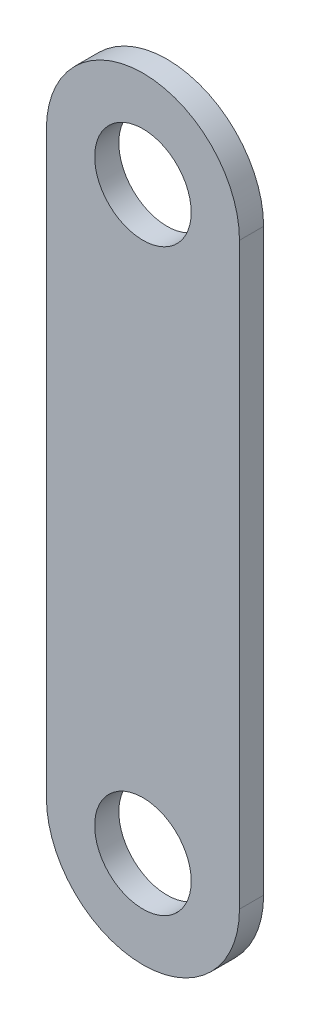
ISO-10303-21;
HEADER;
FILE_DESCRIPTION(('STEP AP214'),'2;1');
FILE_NAME('part.step','',(''),(''),'','','');
FILE_SCHEMA(('AUTOMOTIVE_DESIGN { 1 0 10303 214 1 1 1 1 }'));
ENDSEC;
DATA;
#1=APPLICATION_CONTEXT('core data for automotive mechanical design processes');
#2=APPLICATION_PROTOCOL_DEFINITION('international standard','automotive_design',2000,#1);
#3=PRODUCT_CONTEXT('',#1,'mechanical');
#4=PRODUCT('Part','Part','',(#3));
#5=PRODUCT_RELATED_PRODUCT_CATEGORY('part','',(#4));
#6=PRODUCT_DEFINITION_FORMATION('','',#4);
#7=PRODUCT_DEFINITION_CONTEXT('part definition',#1,'design');
#8=PRODUCT_DEFINITION('design','',#6,#7);
#9=PRODUCT_DEFINITION_SHAPE('','',#8);
#10=(LENGTH_UNIT() NAMED_UNIT(*) SI_UNIT(.MILLI.,.METRE.));
#11=(NAMED_UNIT(*) PLANE_ANGLE_UNIT() SI_UNIT($,.RADIAN.));
#12=(NAMED_UNIT(*) SI_UNIT($,.STERADIAN.) SOLID_ANGLE_UNIT());
#13=UNCERTAINTY_MEASURE_WITH_UNIT(LENGTH_MEASURE(1.E-05),#10,'distance_accuracy_value','');
#14=(GEOMETRIC_REPRESENTATION_CONTEXT(3) GLOBAL_UNCERTAINTY_ASSIGNED_CONTEXT((#13)) GLOBAL_UNIT_ASSIGNED_CONTEXT((#10,
#11,#12)) REPRESENTATION_CONTEXT('',''));
#15=CARTESIAN_POINT('',(0.,0.,0.));
#16=DIRECTION('',(0.,0.,1.));
#17=DIRECTION('',(1.,0.,0.));
#18=AXIS2_PLACEMENT_3D('',#15,#16,#17);
#19=CARTESIAN_POINT('',(-11.0340986575596,-43.0703791177531,3.175));
#20=DIRECTION('',(0.,0.,-1.));
#21=DIRECTION('',(-1.,0.,0.));
#22=AXIS2_PLACEMENT_3D('',#19,#20,#21);
#23=CYLINDRICAL_SURFACE('',#22,12.7);
#24=CARTESIAN_POINT('',(-11.0340986575596,-43.0703791177531,0.));
#25=DIRECTION('',(0.,0.,1.));
#26=DIRECTION('',(1.,0.,0.));
#27=AXIS2_PLACEMENT_3D('',#24,#25,#26);
#28=CIRCLE('',#27,12.7);
#29=CARTESIAN_POINT('',(-23.7340986575596,-43.0703791177531,0.));
#30=VERTEX_POINT('',#29);
#31=CARTESIAN_POINT('',(1.6659013424404,-43.0703791177531,0.));
#32=VERTEX_POINT('',#31);
#33=EDGE_CURVE('E107',#30,#32,#28,.T.);
#34=ORIENTED_EDGE('',*,*,#33,.T.);
#35=DIRECTION('',(0.,0.,-1.));
#36=VECTOR('',#35,1.);
#37=CARTESIAN_POINT('',(1.6659013424404,-43.0703791177531,3.175));
#38=LINE('',#37,#36);
#39=CARTESIAN_POINT('',(1.6659013424404,-43.0703791177531,3.175));
#40=VERTEX_POINT('',#39);
#41=EDGE_CURVE('E11',#40,#32,#38,.T.);
#42=ORIENTED_EDGE('',*,*,#41,.F.);
#43=CARTESIAN_POINT('',(-11.0340986575596,-43.0703791177531,3.175));
#44=DIRECTION('',(0.,0.,1.));
#45=DIRECTION('',(1.,0.,0.));
#46=AXIS2_PLACEMENT_3D('',#43,#44,#45);
#47=CIRCLE('',#46,12.7);
#48=CARTESIAN_POINT('',(-23.7340986575596,-43.0703791177531,3.175));
#49=VERTEX_POINT('',#48);
#50=EDGE_CURVE('E78',#49,#40,#47,.T.);
#51=ORIENTED_EDGE('',*,*,#50,.F.);
#52=DIRECTION('',(0.,0.,-1.));
#53=VECTOR('',#52,1.);
#54=CARTESIAN_POINT('',(-23.7340986575596,-43.0703791177531,3.175));
#55=LINE('',#54,#53);
#56=EDGE_CURVE('E106',#49,#30,#55,.T.);
#57=ORIENTED_EDGE('',*,*,#56,.T.);
#58=EDGE_LOOP('',(#34,#42,#51,#57));
#59=FACE_BOUND('',#58,.T.);
#60=ADVANCED_FACE('F36',(#59),#23,.T.);
#61=CARTESIAN_POINT('',(1.66590134244038,0.,3.175));
#62=DIRECTION('',(1.,0.,0.));
#63=DIRECTION('',(0.,1.,0.));
#64=AXIS2_PLACEMENT_3D('',#61,#62,#63);
#65=PLANE('',#64);
#66=DIRECTION('',(0.,-1.,0.));
#67=VECTOR('',#66,1.);
#68=CARTESIAN_POINT('',(1.66590134244038,0.,0.));
#69=LINE('',#68,#67);
#70=CARTESIAN_POINT('',(1.66590134244038,33.1296208822469,0.));
#71=VERTEX_POINT('',#70);
#72=EDGE_CURVE('E88',#71,#32,#69,.T.);
#73=ORIENTED_EDGE('',*,*,#72,.F.);
#74=DIRECTION('',(0.,0.,-1.));
#75=VECTOR('',#74,1.);
#76=CARTESIAN_POINT('',(1.66590134244038,33.1296208822469,3.175));
#77=LINE('',#76,#75);
#78=CARTESIAN_POINT('',(1.66590134244038,33.1296208822469,3.175));
#79=VERTEX_POINT('',#78);
#80=EDGE_CURVE('E44',#79,#71,#77,.T.);
#81=ORIENTED_EDGE('',*,*,#80,.F.);
#82=DIRECTION('',(0.,-1.,0.));
#83=VECTOR('',#82,1.);
#84=CARTESIAN_POINT('',(1.66590134244038,0.,3.175));
#85=LINE('',#84,#83);
#86=EDGE_CURVE('E86',#79,#40,#85,.T.);
#87=ORIENTED_EDGE('',*,*,#86,.T.);
#88=ORIENTED_EDGE('',*,*,#41,.T.);
#89=EDGE_LOOP('',(#73,#81,#87,#88));
#90=FACE_BOUND('',#89,.T.);
#91=ADVANCED_FACE('F85',(#90),#65,.T.);
#92=CARTESIAN_POINT('',(-11.0340986575596,33.1296208822469,3.175));
#93=DIRECTION('',(0.,0.,-1.));
#94=DIRECTION('',(-1.,0.,0.));
#95=AXIS2_PLACEMENT_3D('',#92,#93,#94);
#96=CYLINDRICAL_SURFACE('',#95,12.7);
#97=CARTESIAN_POINT('',(-11.0340986575596,33.1296208822469,0.));
#98=DIRECTION('',(0.,0.,1.));
#99=DIRECTION('',(1.,0.,0.));
#100=AXIS2_PLACEMENT_3D('',#97,#98,#99);
#101=CIRCLE('',#100,12.7);
#102=CARTESIAN_POINT('',(-23.7340986575596,33.1296208822469,0.));
#103=VERTEX_POINT('',#102);
#104=EDGE_CURVE('E67',#71,#103,#101,.T.);
#105=ORIENTED_EDGE('',*,*,#104,.T.);
#106=DIRECTION('',(0.,0.,-1.));
#107=VECTOR('',#106,1.);
#108=CARTESIAN_POINT('',(-23.7340986575596,33.1296208822469,3.175));
#109=LINE('',#108,#107);
#110=CARTESIAN_POINT('',(-23.7340986575596,33.1296208822469,3.175));
#111=VERTEX_POINT('',#110);
#112=EDGE_CURVE('E89',#111,#103,#109,.T.);
#113=ORIENTED_EDGE('',*,*,#112,.F.);
#114=CARTESIAN_POINT('',(-11.0340986575596,33.1296208822469,3.175));
#115=DIRECTION('',(0.,0.,1.));
#116=DIRECTION('',(1.,0.,0.));
#117=AXIS2_PLACEMENT_3D('',#114,#115,#116);
#118=CIRCLE('',#117,12.7);
#119=EDGE_CURVE('E90',#79,#111,#118,.T.);
#120=ORIENTED_EDGE('',*,*,#119,.F.);
#121=ORIENTED_EDGE('',*,*,#80,.T.);
#122=EDGE_LOOP('',(#105,#113,#120,#121));
#123=FACE_BOUND('',#122,.T.);
#124=ADVANCED_FACE('F91',(#123),#96,.T.);
#125=CARTESIAN_POINT('',(-11.0340986575596,33.1296208822469,3.175));
#126=DIRECTION('',(0.,0.,-1.));
#127=DIRECTION('',(-1.,0.,0.));
#128=AXIS2_PLACEMENT_3D('',#125,#126,#127);
#129=CYLINDRICAL_SURFACE('',#128,6.35);
#130=CARTESIAN_POINT('',(-11.0340986575596,33.1296208822469,3.175));
#131=DIRECTION('',(0.,0.,1.));
#132=DIRECTION('',(1.,0.,0.));
#133=AXIS2_PLACEMENT_3D('',#130,#131,#132);
#134=CIRCLE('',#133,6.35);
#135=CARTESIAN_POINT('',(-4.68409865755962,33.1296208822469,3.175));
#136=VERTEX_POINT('',#135);
#137=EDGE_CURVE('E100',#136,#136,#134,.T.);
#138=ORIENTED_EDGE('',*,*,#137,.T.);
#139=EDGE_LOOP('',(#138));
#140=FACE_BOUND('',#139,.T.);
#141=CARTESIAN_POINT('',(-11.0340986575596,33.1296208822469,0.));
#142=DIRECTION('',(0.,0.,1.));
#143=DIRECTION('',(1.,0.,0.));
#144=AXIS2_PLACEMENT_3D('',#141,#142,#143);
#145=CIRCLE('',#144,6.35);
#146=CARTESIAN_POINT('',(-4.68409865755962,33.1296208822469,0.));
#147=VERTEX_POINT('',#146);
#148=EDGE_CURVE('E113',#147,#147,#145,.T.);
#149=ORIENTED_EDGE('',*,*,#148,.F.);
#150=EDGE_LOOP('',(#149));
#151=FACE_BOUND('',#150,.T.);
#152=ADVANCED_FACE('F132',(#140,#151),#129,.F.);
#153=CARTESIAN_POINT('',(-23.7340986575596,0.,3.175));
#154=DIRECTION('',(1.,0.,0.));
#155=DIRECTION('',(0.,1.,0.));
#156=AXIS2_PLACEMENT_3D('',#153,#154,#155);
#157=PLANE('',#156);
#158=DIRECTION('',(0.,-1.,0.));
#159=VECTOR('',#158,1.);
#160=CARTESIAN_POINT('',(-23.7340986575596,0.,0.));
#161=LINE('',#160,#159);
#162=EDGE_CURVE('E73',#103,#30,#161,.T.);
#163=ORIENTED_EDGE('',*,*,#162,.T.);
#164=ORIENTED_EDGE('',*,*,#56,.F.);
#165=DIRECTION('',(0.,-1.,0.));
#166=VECTOR('',#165,1.);
#167=CARTESIAN_POINT('',(-23.7340986575596,0.,3.175));
#168=LINE('',#167,#166);
#169=EDGE_CURVE('E52',#111,#49,#168,.T.);
#170=ORIENTED_EDGE('',*,*,#169,.F.);
#171=ORIENTED_EDGE('',*,*,#112,.T.);
#172=EDGE_LOOP('',(#163,#164,#170,#171));
#173=FACE_BOUND('',#172,.T.);
#174=ADVANCED_FACE('F119',(#173),#157,.F.);
#175=CARTESIAN_POINT('',(-11.0340986575596,-43.0703791177531,3.175));
#176=DIRECTION('',(0.,0.,-1.));
#177=DIRECTION('',(-1.,0.,0.));
#178=AXIS2_PLACEMENT_3D('',#175,#176,#177);
#179=CYLINDRICAL_SURFACE('',#178,6.35);
#180=CARTESIAN_POINT('',(-11.0340986575596,-43.0703791177531,3.175));
#181=DIRECTION('',(0.,0.,1.));
#182=DIRECTION('',(1.,0.,0.));
#183=AXIS2_PLACEMENT_3D('',#180,#181,#182);
#184=CIRCLE('',#183,6.35);
#185=CARTESIAN_POINT('',(-4.6840986575596,-43.0703791177531,3.175));
#186=VERTEX_POINT('',#185);
#187=EDGE_CURVE('E103',#186,#186,#184,.T.);
#188=ORIENTED_EDGE('',*,*,#187,.T.);
#189=EDGE_LOOP('',(#188));
#190=FACE_BOUND('',#189,.T.);
#191=CARTESIAN_POINT('',(-11.0340986575596,-43.0703791177531,0.));
#192=DIRECTION('',(0.,0.,1.));
#193=DIRECTION('',(1.,0.,0.));
#194=AXIS2_PLACEMENT_3D('',#191,#192,#193);
#195=CIRCLE('',#194,6.35);
#196=CARTESIAN_POINT('',(-4.6840986575596,-43.0703791177531,0.));
#197=VERTEX_POINT('',#196);
#198=EDGE_CURVE('E96',#197,#197,#195,.T.);
#199=ORIENTED_EDGE('',*,*,#198,.F.);
#200=EDGE_LOOP('',(#199));
#201=FACE_BOUND('',#200,.T.);
#202=ADVANCED_FACE('F137',(#190,#201),#179,.F.);
#203=CARTESIAN_POINT('',(0.,0.,3.175));
#204=DIRECTION('',(0.,0.,1.));
#205=DIRECTION('',(1.,0.,0.));
#206=AXIS2_PLACEMENT_3D('',#203,#204,#205);
#207=PLANE('',#206);
#208=ORIENTED_EDGE('',*,*,#50,.T.);
#209=ORIENTED_EDGE('',*,*,#86,.F.);
#210=ORIENTED_EDGE('',*,*,#119,.T.);
#211=ORIENTED_EDGE('',*,*,#169,.T.);
#212=EDGE_LOOP('',(#208,#209,#210,#211));
#213=FACE_BOUND('',#212,.T.);
#214=ORIENTED_EDGE('',*,*,#137,.F.);
#215=EDGE_LOOP('',(#214));
#216=FACE_BOUND('',#215,.T.);
#217=ORIENTED_EDGE('',*,*,#187,.F.);
#218=EDGE_LOOP('',(#217));
#219=FACE_BOUND('',#218,.T.);
#220=ADVANCED_FACE('F93',(#213,#216,#219),#207,.T.);
#221=CARTESIAN_POINT('',(0.,0.,0.));
#222=DIRECTION('',(0.,0.,1.));
#223=DIRECTION('',(1.,0.,0.));
#224=AXIS2_PLACEMENT_3D('',#221,#222,#223);
#225=PLANE('',#224);
#226=ORIENTED_EDGE('',*,*,#33,.F.);
#227=ORIENTED_EDGE('',*,*,#162,.F.);
#228=ORIENTED_EDGE('',*,*,#104,.F.);
#229=ORIENTED_EDGE('',*,*,#72,.T.);
#230=EDGE_LOOP('',(#226,#227,#228,#229));
#231=FACE_BOUND('',#230,.T.);
#232=ORIENTED_EDGE('',*,*,#148,.T.);
#233=EDGE_LOOP('',(#232));
#234=FACE_BOUND('',#233,.T.);
#235=ORIENTED_EDGE('',*,*,#198,.T.);
#236=EDGE_LOOP('',(#235));
#237=FACE_BOUND('',#236,.T.);
#238=ADVANCED_FACE('F122',(#231,#234,#237),#225,.F.);
#239=CLOSED_SHELL('',(#60,#91,#124,#152,#174,#202,#220,#238));
#240=MANIFOLD_SOLID_BREP('B2',#239);
#241=ADVANCED_BREP_SHAPE_REPRESENTATION('',(#18,#240),#14);
#242=SHAPE_DEFINITION_REPRESENTATION(#9,#241);
ENDSEC;
END-ISO-10303-21;
